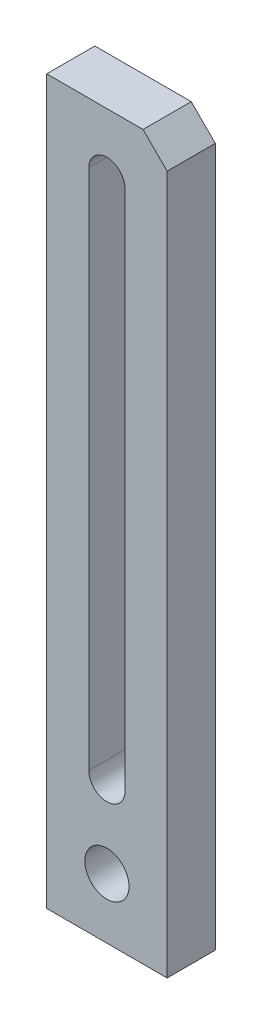
ISO-10303-21;
HEADER;
FILE_DESCRIPTION(('STEP AP214'),'2;1');
FILE_NAME('part.step','',(''),(''),'','','');
FILE_SCHEMA(('AUTOMOTIVE_DESIGN { 1 0 10303 214 1 1 1 1 }'));
ENDSEC;
DATA;
#1=APPLICATION_CONTEXT('core data for automotive mechanical design processes');
#2=APPLICATION_PROTOCOL_DEFINITION('international standard','automotive_design',2000,#1);
#3=PRODUCT_CONTEXT('',#1,'mechanical');
#4=PRODUCT('Part','Part','',(#3));
#5=PRODUCT_RELATED_PRODUCT_CATEGORY('part','',(#4));
#6=PRODUCT_DEFINITION_FORMATION('','',#4);
#7=PRODUCT_DEFINITION_CONTEXT('part definition',#1,'design');
#8=PRODUCT_DEFINITION('design','',#6,#7);
#9=PRODUCT_DEFINITION_SHAPE('','',#8);
#10=(LENGTH_UNIT() NAMED_UNIT(*) SI_UNIT(.MILLI.,.METRE.));
#11=(NAMED_UNIT(*) PLANE_ANGLE_UNIT() SI_UNIT($,.RADIAN.));
#12=(NAMED_UNIT(*) SI_UNIT($,.STERADIAN.) SOLID_ANGLE_UNIT());
#13=UNCERTAINTY_MEASURE_WITH_UNIT(LENGTH_MEASURE(1.E-05),#10,'distance_accuracy_value','');
#14=(GEOMETRIC_REPRESENTATION_CONTEXT(3) GLOBAL_UNCERTAINTY_ASSIGNED_CONTEXT((#13)) GLOBAL_UNIT_ASSIGNED_CONTEXT((#10,
#11,#12)) REPRESENTATION_CONTEXT('',''));
#15=CARTESIAN_POINT('',(0.,0.,0.));
#16=DIRECTION('',(0.,0.,1.));
#17=DIRECTION('',(1.,0.,0.));
#18=AXIS2_PLACEMENT_3D('',#15,#16,#17);
#19=CARTESIAN_POINT('',(15.,90.,12.));
#20=DIRECTION('',(-1.,0.,0.));
#21=DIRECTION('',(0.,-1.,0.));
#22=AXIS2_PLACEMENT_3D('',#19,#20,#21);
#23=PLANE('',#22);
#24=DIRECTION('',(0.,1.,0.));
#25=VECTOR('',#24,1.);
#26=CARTESIAN_POINT('',(15.,90.,0.));
#27=LINE('',#26,#25);
#28=CARTESIAN_POINT('',(15.,-90.,0.));
#29=VERTEX_POINT('',#28);
#30=CARTESIAN_POINT('',(15.,83.9999999999999,0.));
#31=VERTEX_POINT('',#30);
#32=EDGE_CURVE('E150',#29,#31,#27,.T.);
#33=ORIENTED_EDGE('',*,*,#32,.T.);
#34=DIRECTION('',(0.,0.,1.));
#35=VECTOR('',#34,1.);
#36=CARTESIAN_POINT('',(15.,83.9999999999999,12.));
#37=LINE('',#36,#35);
#38=CARTESIAN_POINT('',(15.,83.9999999999999,12.));
#39=VERTEX_POINT('',#38);
#40=EDGE_CURVE('E46',#31,#39,#37,.T.);
#41=ORIENTED_EDGE('',*,*,#40,.T.);
#42=DIRECTION('',(0.,1.,0.));
#43=VECTOR('',#42,1.);
#44=CARTESIAN_POINT('',(15.,90.,12.));
#45=LINE('',#44,#43);
#46=CARTESIAN_POINT('',(15.,-90.,12.));
#47=VERTEX_POINT('',#46);
#48=EDGE_CURVE('E159',#47,#39,#45,.T.);
#49=ORIENTED_EDGE('',*,*,#48,.F.);
#50=DIRECTION('',(0.,0.,-1.));
#51=VECTOR('',#50,1.);
#52=CARTESIAN_POINT('',(15.,-90.,12.));
#53=LINE('',#52,#51);
#54=EDGE_CURVE('E168',#47,#29,#53,.T.);
#55=ORIENTED_EDGE('',*,*,#54,.T.);
#56=EDGE_LOOP('',(#33,#41,#49,#55));
#57=FACE_BOUND('',#56,.T.);
#58=ADVANCED_FACE('F37',(#57),#23,.F.);
#59=CARTESIAN_POINT('',(-15.,90.,12.));
#60=DIRECTION('',(0.,-1.,0.));
#61=DIRECTION('',(0.,0.,-1.));
#62=AXIS2_PLACEMENT_3D('',#59,#60,#61);
#63=PLANE('',#62);
#64=DIRECTION('',(-1.,0.,0.));
#65=VECTOR('',#64,1.);
#66=CARTESIAN_POINT('',(-15.,90.,12.));
#67=LINE('',#66,#65);
#68=CARTESIAN_POINT('',(8.99999999999995,90.,12.));
#69=VERTEX_POINT('',#68);
#70=CARTESIAN_POINT('',(-15.,90.,12.));
#71=VERTEX_POINT('',#70);
#72=EDGE_CURVE('E161',#69,#71,#67,.T.);
#73=ORIENTED_EDGE('',*,*,#72,.F.);
#74=DIRECTION('',(0.,0.,-1.));
#75=VECTOR('',#74,1.);
#76=CARTESIAN_POINT('',(8.99999999999995,90.,12.));
#77=LINE('',#76,#75);
#78=CARTESIAN_POINT('',(8.99999999999995,90.,0.));
#79=VERTEX_POINT('',#78);
#80=EDGE_CURVE('E183',#69,#79,#77,.T.);
#81=ORIENTED_EDGE('',*,*,#80,.T.);
#82=DIRECTION('',(-1.,0.,0.));
#83=VECTOR('',#82,1.);
#84=CARTESIAN_POINT('',(-15.,90.,0.));
#85=LINE('',#84,#83);
#86=CARTESIAN_POINT('',(-15.,90.,0.));
#87=VERTEX_POINT('',#86);
#88=EDGE_CURVE('E170',#79,#87,#85,.T.);
#89=ORIENTED_EDGE('',*,*,#88,.T.);
#90=DIRECTION('',(0.,0.,-1.));
#91=VECTOR('',#90,1.);
#92=CARTESIAN_POINT('',(-15.,90.,12.));
#93=LINE('',#92,#91);
#94=EDGE_CURVE('E180',#71,#87,#93,.T.);
#95=ORIENTED_EDGE('',*,*,#94,.F.);
#96=EDGE_LOOP('',(#73,#81,#89,#95));
#97=FACE_BOUND('',#96,.T.);
#98=ADVANCED_FACE('F189',(#97),#63,.F.);
#99=CARTESIAN_POINT('',(-15.,90.,12.));
#100=DIRECTION('',(1.,0.,0.));
#101=DIRECTION('',(0.,1.,0.));
#102=AXIS2_PLACEMENT_3D('',#99,#100,#101);
#103=PLANE('',#102);
#104=DIRECTION('',(0.,-1.,0.));
#105=VECTOR('',#104,1.);
#106=CARTESIAN_POINT('',(-15.,90.,0.));
#107=LINE('',#106,#105);
#108=CARTESIAN_POINT('',(-15.,-90.,0.));
#109=VERTEX_POINT('',#108);
#110=EDGE_CURVE('E172',#87,#109,#107,.T.);
#111=ORIENTED_EDGE('',*,*,#110,.T.);
#112=DIRECTION('',(0.,0.,-1.));
#113=VECTOR('',#112,1.);
#114=CARTESIAN_POINT('',(-15.,-90.,12.));
#115=LINE('',#114,#113);
#116=CARTESIAN_POINT('',(-15.,-90.,12.));
#117=VERTEX_POINT('',#116);
#118=EDGE_CURVE('E177',#117,#109,#115,.T.);
#119=ORIENTED_EDGE('',*,*,#118,.F.);
#120=DIRECTION('',(0.,-1.,0.));
#121=VECTOR('',#120,1.);
#122=CARTESIAN_POINT('',(-15.,90.,12.));
#123=LINE('',#122,#121);
#124=EDGE_CURVE('E164',#71,#117,#123,.T.);
#125=ORIENTED_EDGE('',*,*,#124,.F.);
#126=ORIENTED_EDGE('',*,*,#94,.T.);
#127=EDGE_LOOP('',(#111,#119,#125,#126));
#128=FACE_BOUND('',#127,.T.);
#129=ADVANCED_FACE('F197',(#128),#103,.F.);
#130=CARTESIAN_POINT('',(-15.,-90.,12.));
#131=DIRECTION('',(0.,1.,0.));
#132=DIRECTION('',(0.,0.,1.));
#133=AXIS2_PLACEMENT_3D('',#130,#131,#132);
#134=PLANE('',#133);
#135=DIRECTION('',(1.,0.,0.));
#136=VECTOR('',#135,1.);
#137=CARTESIAN_POINT('',(-15.,-90.,0.));
#138=LINE('',#137,#136);
#139=EDGE_CURVE('E162',#109,#29,#138,.T.);
#140=ORIENTED_EDGE('',*,*,#139,.T.);
#141=ORIENTED_EDGE('',*,*,#54,.F.);
#142=DIRECTION('',(1.,0.,0.));
#143=VECTOR('',#142,1.);
#144=CARTESIAN_POINT('',(-15.,-90.,12.));
#145=LINE('',#144,#143);
#146=EDGE_CURVE('E166',#117,#47,#145,.T.);
#147=ORIENTED_EDGE('',*,*,#146,.F.);
#148=ORIENTED_EDGE('',*,*,#118,.T.);
#149=EDGE_LOOP('',(#140,#141,#147,#148));
#150=FACE_BOUND('',#149,.T.);
#151=ADVANCED_FACE('F201',(#150),#134,.F.);
#152=CARTESIAN_POINT('',(0.,0.,12.));
#153=DIRECTION('',(0.,0.,1.));
#154=DIRECTION('',(1.,0.,0.));
#155=AXIS2_PLACEMENT_3D('',#152,#153,#154);
#156=PLANE('',#155);
#157=CARTESIAN_POINT('',(0.,75.,12.));
#158=DIRECTION('',(0.,0.,1.));
#159=DIRECTION('',(1.,0.,0.));
#160=AXIS2_PLACEMENT_3D('',#157,#158,#159);
#161=CIRCLE('',#160,4.5);
#162=CARTESIAN_POINT('',(4.49999999999999,75.,12.));
#163=VERTEX_POINT('',#162);
#164=CARTESIAN_POINT('',(-4.5,75.,12.));
#165=VERTEX_POINT('',#164);
#166=EDGE_CURVE('E116',#163,#165,#161,.T.);
#167=ORIENTED_EDGE('',*,*,#166,.F.);
#168=DIRECTION('',(0.,1.,0.));
#169=VECTOR('',#168,1.);
#170=CARTESIAN_POINT('',(4.49999999999999,75.,12.));
#171=LINE('',#170,#169);
#172=CARTESIAN_POINT('',(4.49999999999999,-55.,12.));
#173=VERTEX_POINT('',#172);
#174=EDGE_CURVE('E134',#173,#163,#171,.T.);
#175=ORIENTED_EDGE('',*,*,#174,.F.);
#176=CARTESIAN_POINT('',(0.,-55.,12.));
#177=DIRECTION('',(0.,0.,1.));
#178=DIRECTION('',(1.,0.,0.));
#179=AXIS2_PLACEMENT_3D('',#176,#177,#178);
#180=CIRCLE('',#179,4.5);
#181=CARTESIAN_POINT('',(-4.5,-55.,12.));
#182=VERTEX_POINT('',#181);
#183=EDGE_CURVE('E137',#182,#173,#180,.T.);
#184=ORIENTED_EDGE('',*,*,#183,.F.);
#185=DIRECTION('',(0.,-1.,0.));
#186=VECTOR('',#185,1.);
#187=CARTESIAN_POINT('',(-4.5,75.,12.));
#188=LINE('',#187,#186);
#189=EDGE_CURVE('E143',#165,#182,#188,.T.);
#190=ORIENTED_EDGE('',*,*,#189,.F.);
#191=EDGE_LOOP('',(#167,#175,#184,#190));
#192=FACE_BOUND('',#191,.T.);
#193=CARTESIAN_POINT('',(0.,-75.,12.));
#194=DIRECTION('',(0.,0.,1.));
#195=DIRECTION('',(1.,0.,0.));
#196=AXIS2_PLACEMENT_3D('',#193,#194,#195);
#197=CIRCLE('',#196,5.5);
#198=CARTESIAN_POINT('',(5.49999999999999,-75.,12.));
#199=VERTEX_POINT('',#198);
#200=EDGE_CURVE('E156',#199,#199,#197,.T.);
#201=ORIENTED_EDGE('',*,*,#200,.F.);
#202=EDGE_LOOP('',(#201));
#203=FACE_BOUND('',#202,.T.);
#204=ORIENTED_EDGE('',*,*,#48,.T.);
#205=DIRECTION('',(0.707106781186546,-0.707106781186549,0.));
#206=VECTOR('',#205,1.);
#207=CARTESIAN_POINT('',(49.5,49.4999999999997,12.));
#208=LINE('',#207,#206);
#209=EDGE_CURVE('E11',#39,#69,#208,.F.);
#210=ORIENTED_EDGE('',*,*,#209,.T.);
#211=ORIENTED_EDGE('',*,*,#72,.T.);
#212=ORIENTED_EDGE('',*,*,#124,.T.);
#213=ORIENTED_EDGE('',*,*,#146,.T.);
#214=EDGE_LOOP('',(#204,#210,#211,#212,#213));
#215=FACE_BOUND('',#214,.T.);
#216=ADVANCED_FACE('F204',(#192,#203,#215),#156,.T.);
#217=CARTESIAN_POINT('',(0.,0.,0.));
#218=DIRECTION('',(0.,0.,1.));
#219=DIRECTION('',(1.,0.,0.));
#220=AXIS2_PLACEMENT_3D('',#217,#218,#219);
#221=PLANE('',#220);
#222=DIRECTION('',(0.,1.,0.));
#223=VECTOR('',#222,1.);
#224=CARTESIAN_POINT('',(4.49999999999999,75.,0.));
#225=LINE('',#224,#223);
#226=CARTESIAN_POINT('',(4.49999999999999,-55.,0.));
#227=VERTEX_POINT('',#226);
#228=CARTESIAN_POINT('',(4.49999999999999,75.,0.));
#229=VERTEX_POINT('',#228);
#230=EDGE_CURVE('E121',#227,#229,#225,.T.);
#231=ORIENTED_EDGE('',*,*,#230,.T.);
#232=CARTESIAN_POINT('',(0.,75.,0.));
#233=DIRECTION('',(0.,0.,1.));
#234=DIRECTION('',(1.,0.,0.));
#235=AXIS2_PLACEMENT_3D('',#232,#233,#234);
#236=CIRCLE('',#235,4.5);
#237=CARTESIAN_POINT('',(-4.5,75.,0.));
#238=VERTEX_POINT('',#237);
#239=EDGE_CURVE('E113',#229,#238,#236,.T.);
#240=ORIENTED_EDGE('',*,*,#239,.T.);
#241=DIRECTION('',(0.,-1.,0.));
#242=VECTOR('',#241,1.);
#243=CARTESIAN_POINT('',(-4.5,75.,0.));
#244=LINE('',#243,#242);
#245=CARTESIAN_POINT('',(-4.5,-55.,0.));
#246=VERTEX_POINT('',#245);
#247=EDGE_CURVE('E125',#238,#246,#244,.T.);
#248=ORIENTED_EDGE('',*,*,#247,.T.);
#249=CARTESIAN_POINT('',(0.,-55.,0.));
#250=DIRECTION('',(0.,0.,1.));
#251=DIRECTION('',(1.,0.,0.));
#252=AXIS2_PLACEMENT_3D('',#249,#250,#251);
#253=CIRCLE('',#252,4.5);
#254=EDGE_CURVE('E129',#246,#227,#253,.T.);
#255=ORIENTED_EDGE('',*,*,#254,.T.);
#256=EDGE_LOOP('',(#231,#240,#248,#255));
#257=FACE_BOUND('',#256,.T.);
#258=CARTESIAN_POINT('',(0.,-75.,0.));
#259=DIRECTION('',(0.,0.,1.));
#260=DIRECTION('',(1.,0.,0.));
#261=AXIS2_PLACEMENT_3D('',#258,#259,#260);
#262=CIRCLE('',#261,5.5);
#263=CARTESIAN_POINT('',(5.49999999999999,-75.,0.));
#264=VERTEX_POINT('',#263);
#265=EDGE_CURVE('E144',#264,#264,#262,.T.);
#266=ORIENTED_EDGE('',*,*,#265,.T.);
#267=EDGE_LOOP('',(#266));
#268=FACE_BOUND('',#267,.T.);
#269=ORIENTED_EDGE('',*,*,#88,.F.);
#270=DIRECTION('',(-0.707106781186546,0.707106781186549,0.));
#271=VECTOR('',#270,1.);
#272=CARTESIAN_POINT('',(8.99999999999995,90.,0.));
#273=LINE('',#272,#271);
#274=EDGE_CURVE('E60',#79,#31,#273,.F.);
#275=ORIENTED_EDGE('',*,*,#274,.T.);
#276=ORIENTED_EDGE('',*,*,#32,.F.);
#277=ORIENTED_EDGE('',*,*,#139,.F.);
#278=ORIENTED_EDGE('',*,*,#110,.F.);
#279=EDGE_LOOP('',(#269,#275,#276,#277,#278));
#280=FACE_BOUND('',#279,.T.);
#281=ADVANCED_FACE('F131',(#257,#268,#280),#221,.F.);
#282=CARTESIAN_POINT('',(0.,-75.,0.));
#283=DIRECTION('',(0.,0.,1.));
#284=DIRECTION('',(1.,0.,0.));
#285=AXIS2_PLACEMENT_3D('',#282,#283,#284);
#286=CYLINDRICAL_SURFACE('',#285,5.5);
#287=ORIENTED_EDGE('',*,*,#265,.F.);
#288=EDGE_LOOP('',(#287));
#289=FACE_BOUND('',#288,.T.);
#290=ORIENTED_EDGE('',*,*,#200,.T.);
#291=EDGE_LOOP('',(#290));
#292=FACE_BOUND('',#291,.T.);
#293=ADVANCED_FACE('F223',(#289,#292),#286,.F.);
#294=CARTESIAN_POINT('',(0.,75.,0.));
#295=DIRECTION('',(0.,0.,1.));
#296=DIRECTION('',(1.,0.,0.));
#297=AXIS2_PLACEMENT_3D('',#294,#295,#296);
#298=CYLINDRICAL_SURFACE('',#297,4.5);
#299=ORIENTED_EDGE('',*,*,#166,.T.);
#300=DIRECTION('',(0.,0.,1.));
#301=VECTOR('',#300,1.);
#302=CARTESIAN_POINT('',(-4.5,75.,0.));
#303=LINE('',#302,#301);
#304=EDGE_CURVE('E109',#238,#165,#303,.T.);
#305=ORIENTED_EDGE('',*,*,#304,.F.);
#306=ORIENTED_EDGE('',*,*,#239,.F.);
#307=DIRECTION('',(0.,0.,1.));
#308=VECTOR('',#307,1.);
#309=CARTESIAN_POINT('',(4.49999999999999,75.,0.));
#310=LINE('',#309,#308);
#311=EDGE_CURVE('E148',#229,#163,#310,.T.);
#312=ORIENTED_EDGE('',*,*,#311,.T.);
#313=EDGE_LOOP('',(#299,#305,#306,#312));
#314=FACE_BOUND('',#313,.T.);
#315=ADVANCED_FACE('F111',(#314),#298,.F.);
#316=CARTESIAN_POINT('',(4.49999999999999,75.,0.));
#317=DIRECTION('',(1.,0.,0.));
#318=DIRECTION('',(0.,1.,0.));
#319=AXIS2_PLACEMENT_3D('',#316,#317,#318);
#320=PLANE('',#319);
#321=ORIENTED_EDGE('',*,*,#174,.T.);
#322=ORIENTED_EDGE('',*,*,#311,.F.);
#323=ORIENTED_EDGE('',*,*,#230,.F.);
#324=DIRECTION('',(0.,0.,1.));
#325=VECTOR('',#324,1.);
#326=CARTESIAN_POINT('',(4.49999999999999,-55.,0.));
#327=LINE('',#326,#325);
#328=EDGE_CURVE('E151',#227,#173,#327,.T.);
#329=ORIENTED_EDGE('',*,*,#328,.T.);
#330=EDGE_LOOP('',(#321,#322,#323,#329));
#331=FACE_BOUND('',#330,.T.);
#332=ADVANCED_FACE('F231',(#331),#320,.F.);
#333=CARTESIAN_POINT('',(0.,-55.,0.));
#334=DIRECTION('',(0.,0.,1.));
#335=DIRECTION('',(1.,0.,0.));
#336=AXIS2_PLACEMENT_3D('',#333,#334,#335);
#337=CYLINDRICAL_SURFACE('',#336,4.5);
#338=ORIENTED_EDGE('',*,*,#183,.T.);
#339=ORIENTED_EDGE('',*,*,#328,.F.);
#340=ORIENTED_EDGE('',*,*,#254,.F.);
#341=DIRECTION('',(0.,0.,1.));
#342=VECTOR('',#341,1.);
#343=CARTESIAN_POINT('',(-4.5,-55.,0.));
#344=LINE('',#343,#342);
#345=EDGE_CURVE('E120',#246,#182,#344,.T.);
#346=ORIENTED_EDGE('',*,*,#345,.T.);
#347=EDGE_LOOP('',(#338,#339,#340,#346));
#348=FACE_BOUND('',#347,.T.);
#349=ADVANCED_FACE('F209',(#348),#337,.F.);
#350=CARTESIAN_POINT('',(-4.5,75.,0.));
#351=DIRECTION('',(-1.,0.,0.));
#352=DIRECTION('',(0.,-1.,0.));
#353=AXIS2_PLACEMENT_3D('',#350,#351,#352);
#354=PLANE('',#353);
#355=ORIENTED_EDGE('',*,*,#189,.T.);
#356=ORIENTED_EDGE('',*,*,#345,.F.);
#357=ORIENTED_EDGE('',*,*,#247,.F.);
#358=ORIENTED_EDGE('',*,*,#304,.T.);
#359=EDGE_LOOP('',(#355,#356,#357,#358));
#360=FACE_BOUND('',#359,.T.);
#361=ADVANCED_FACE('F126',(#360),#354,.F.);
#362=CARTESIAN_POINT('',(8.99999999999995,90.,12.));
#363=DIRECTION('',(-0.707106781186549,-0.707106781186546,0.));
#364=DIRECTION('',(0.,0.,-1.));
#365=AXIS2_PLACEMENT_3D('',#362,#363,#364);
#366=PLANE('',#365);
#367=ORIENTED_EDGE('',*,*,#209,.F.);
#368=ORIENTED_EDGE('',*,*,#40,.F.);
#369=ORIENTED_EDGE('',*,*,#274,.F.);
#370=ORIENTED_EDGE('',*,*,#80,.F.);
#371=EDGE_LOOP('',(#367,#368,#369,#370));
#372=FACE_BOUND('',#371,.T.);
#373=ADVANCED_FACE('F40',(#372),#366,.F.);
#374=CLOSED_SHELL('',(#58,#98,#129,#151,#216,#281,#293,#315,#332,#349,#361,#373));
#375=MANIFOLD_SOLID_BREP('B2',#374);
#376=ADVANCED_BREP_SHAPE_REPRESENTATION('',(#18,#375),#14);
#377=SHAPE_DEFINITION_REPRESENTATION(#9,#376);
ENDSEC;
END-ISO-10303-21;
